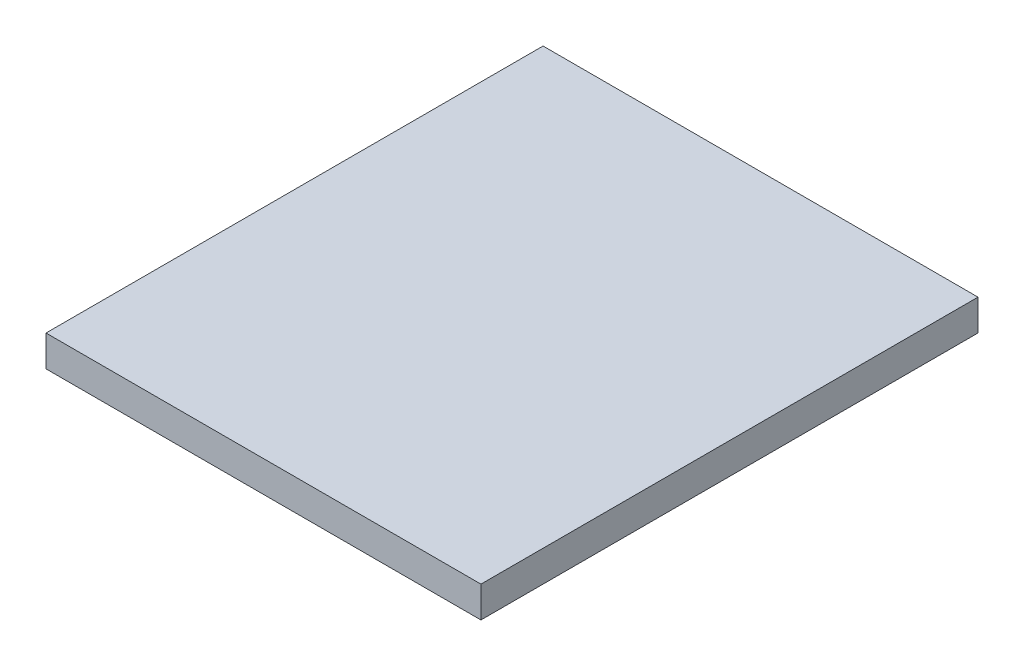
ISO-10303-21;
HEADER;
FILE_DESCRIPTION(('STEP AP214'),'2;1');
FILE_NAME('part.step','',(''),(''),'','','');
FILE_SCHEMA(('AUTOMOTIVE_DESIGN { 1 0 10303 214 1 1 1 1 }'));
ENDSEC;
DATA;
#1=APPLICATION_CONTEXT('core data for automotive mechanical design processes');
#2=APPLICATION_PROTOCOL_DEFINITION('international standard','automotive_design',2000,#1);
#3=PRODUCT_CONTEXT('',#1,'mechanical');
#4=PRODUCT('Part','Part','',(#3));
#5=PRODUCT_RELATED_PRODUCT_CATEGORY('part','',(#4));
#6=PRODUCT_DEFINITION_FORMATION('','',#4);
#7=PRODUCT_DEFINITION_CONTEXT('part definition',#1,'design');
#8=PRODUCT_DEFINITION('design','',#6,#7);
#9=PRODUCT_DEFINITION_SHAPE('','',#8);
#10=(LENGTH_UNIT() NAMED_UNIT(*) SI_UNIT(.MILLI.,.METRE.));
#11=(NAMED_UNIT(*) PLANE_ANGLE_UNIT() SI_UNIT($,.RADIAN.));
#12=(NAMED_UNIT(*) SI_UNIT($,.STERADIAN.) SOLID_ANGLE_UNIT());
#13=UNCERTAINTY_MEASURE_WITH_UNIT(LENGTH_MEASURE(1.E-05),#10,'distance_accuracy_value','');
#14=(GEOMETRIC_REPRESENTATION_CONTEXT(3) GLOBAL_UNCERTAINTY_ASSIGNED_CONTEXT((#13)) GLOBAL_UNIT_ASSIGNED_CONTEXT((#10,
#11,#12)) REPRESENTATION_CONTEXT('',''));
#15=CARTESIAN_POINT('',(0.,0.,0.));
#16=DIRECTION('',(0.,0.,1.));
#17=DIRECTION('',(1.,0.,0.));
#18=AXIS2_PLACEMENT_3D('',#15,#16,#17);
#19=CARTESIAN_POINT('',(-355.6,25.4,-406.4));
#20=DIRECTION('',(1.,0.,0.));
#21=DIRECTION('',(0.,0.,-1.));
#22=AXIS2_PLACEMENT_3D('',#19,#20,#21);
#23=PLANE('',#22);
#24=DIRECTION('',(0.,0.,1.));
#25=VECTOR('',#24,1.);
#26=CARTESIAN_POINT('',(-355.6,-25.4,-406.4));
#27=LINE('',#26,#25);
#28=CARTESIAN_POINT('',(-355.6,-25.4,-406.4));
#29=VERTEX_POINT('',#28);
#30=CARTESIAN_POINT('',(-355.6,-25.4,406.4));
#31=VERTEX_POINT('',#30);
#32=EDGE_CURVE('E96',#29,#31,#27,.T.);
#33=ORIENTED_EDGE('',*,*,#32,.T.);
#34=DIRECTION('',(0.,-1.,0.));
#35=VECTOR('',#34,1.);
#36=CARTESIAN_POINT('',(-355.6,25.4,406.4));
#37=LINE('',#36,#35);
#38=CARTESIAN_POINT('',(-355.6,25.4,406.4));
#39=VERTEX_POINT('',#38);
#40=EDGE_CURVE('E11',#39,#31,#37,.T.);
#41=ORIENTED_EDGE('',*,*,#40,.F.);
#42=DIRECTION('',(0.,0.,1.));
#43=VECTOR('',#42,1.);
#44=CARTESIAN_POINT('',(-355.6,25.4,-406.4));
#45=LINE('',#44,#43);
#46=CARTESIAN_POINT('',(-355.6,25.4,-406.4));
#47=VERTEX_POINT('',#46);
#48=EDGE_CURVE('E84',#47,#39,#45,.T.);
#49=ORIENTED_EDGE('',*,*,#48,.F.);
#50=DIRECTION('',(0.,-1.,0.));
#51=VECTOR('',#50,1.);
#52=CARTESIAN_POINT('',(-355.6,25.4,-406.4));
#53=LINE('',#52,#51);
#54=EDGE_CURVE('E92',#47,#29,#53,.T.);
#55=ORIENTED_EDGE('',*,*,#54,.T.);
#56=EDGE_LOOP('',(#33,#41,#49,#55));
#57=FACE_BOUND('',#56,.T.);
#58=ADVANCED_FACE('F33',(#57),#23,.F.);
#59=CARTESIAN_POINT('',(-355.6,25.4,406.4));
#60=DIRECTION('',(0.,0.,-1.));
#61=DIRECTION('',(-1.,0.,0.));
#62=AXIS2_PLACEMENT_3D('',#59,#60,#61);
#63=PLANE('',#62);
#64=DIRECTION('',(1.,0.,0.));
#65=VECTOR('',#64,1.);
#66=CARTESIAN_POINT('',(-355.6,-25.4,406.4));
#67=LINE('',#66,#65);
#68=CARTESIAN_POINT('',(355.6,-25.4,406.4));
#69=VERTEX_POINT('',#68);
#70=EDGE_CURVE('E88',#31,#69,#67,.T.);
#71=ORIENTED_EDGE('',*,*,#70,.T.);
#72=DIRECTION('',(0.,-1.,0.));
#73=VECTOR('',#72,1.);
#74=CARTESIAN_POINT('',(355.6,25.4,406.4));
#75=LINE('',#74,#73);
#76=CARTESIAN_POINT('',(355.6,25.4,406.4));
#77=VERTEX_POINT('',#76);
#78=EDGE_CURVE('E41',#77,#69,#75,.T.);
#79=ORIENTED_EDGE('',*,*,#78,.F.);
#80=DIRECTION('',(1.,0.,0.));
#81=VECTOR('',#80,1.);
#82=CARTESIAN_POINT('',(-355.6,25.4,406.4));
#83=LINE('',#82,#81);
#84=EDGE_CURVE('E79',#39,#77,#83,.T.);
#85=ORIENTED_EDGE('',*,*,#84,.F.);
#86=ORIENTED_EDGE('',*,*,#40,.T.);
#87=EDGE_LOOP('',(#71,#79,#85,#86));
#88=FACE_BOUND('',#87,.T.);
#89=ADVANCED_FACE('F87',(#88),#63,.F.);
#90=CARTESIAN_POINT('',(355.6,25.4,-406.4));
#91=DIRECTION('',(-1.,0.,0.));
#92=DIRECTION('',(0.,0.,1.));
#93=AXIS2_PLACEMENT_3D('',#90,#91,#92);
#94=PLANE('',#93);
#95=DIRECTION('',(0.,0.,-1.));
#96=VECTOR('',#95,1.);
#97=CARTESIAN_POINT('',(355.6,-25.4,-406.4));
#98=LINE('',#97,#96);
#99=CARTESIAN_POINT('',(355.6,-25.4,-406.4));
#100=VERTEX_POINT('',#99);
#101=EDGE_CURVE('E66',#69,#100,#98,.T.);
#102=ORIENTED_EDGE('',*,*,#101,.T.);
#103=DIRECTION('',(0.,-1.,0.));
#104=VECTOR('',#103,1.);
#105=CARTESIAN_POINT('',(355.6,25.4,-406.4));
#106=LINE('',#105,#104);
#107=CARTESIAN_POINT('',(355.6,25.4,-406.4));
#108=VERTEX_POINT('',#107);
#109=EDGE_CURVE('E89',#108,#100,#106,.T.);
#110=ORIENTED_EDGE('',*,*,#109,.F.);
#111=DIRECTION('',(0.,0.,-1.));
#112=VECTOR('',#111,1.);
#113=CARTESIAN_POINT('',(355.6,25.4,-406.4));
#114=LINE('',#113,#112);
#115=EDGE_CURVE('E82',#77,#108,#114,.T.);
#116=ORIENTED_EDGE('',*,*,#115,.F.);
#117=ORIENTED_EDGE('',*,*,#78,.T.);
#118=EDGE_LOOP('',(#102,#110,#116,#117));
#119=FACE_BOUND('',#118,.T.);
#120=ADVANCED_FACE('F90',(#119),#94,.F.);
#121=CARTESIAN_POINT('',(-355.6,25.4,-406.4));
#122=DIRECTION('',(0.,0.,1.));
#123=DIRECTION('',(1.,0.,0.));
#124=AXIS2_PLACEMENT_3D('',#121,#122,#123);
#125=PLANE('',#124);
#126=DIRECTION('',(-1.,0.,0.));
#127=VECTOR('',#126,1.);
#128=CARTESIAN_POINT('',(-355.6,-25.4,-406.4));
#129=LINE('',#128,#127);
#130=EDGE_CURVE('E72',#100,#29,#129,.T.);
#131=ORIENTED_EDGE('',*,*,#130,.T.);
#132=ORIENTED_EDGE('',*,*,#54,.F.);
#133=DIRECTION('',(-1.,0.,0.));
#134=VECTOR('',#133,1.);
#135=CARTESIAN_POINT('',(-355.6,25.4,-406.4));
#136=LINE('',#135,#134);
#137=EDGE_CURVE('E49',#108,#47,#136,.T.);
#138=ORIENTED_EDGE('',*,*,#137,.F.);
#139=ORIENTED_EDGE('',*,*,#109,.T.);
#140=EDGE_LOOP('',(#131,#132,#138,#139));
#141=FACE_BOUND('',#140,.T.);
#142=ADVANCED_FACE('F103',(#141),#125,.F.);
#143=CARTESIAN_POINT('',(0.,25.4,0.));
#144=DIRECTION('',(0.,1.,0.));
#145=DIRECTION('',(0.,0.,1.));
#146=AXIS2_PLACEMENT_3D('',#143,#144,#145);
#147=PLANE('',#146);
#148=ORIENTED_EDGE('',*,*,#48,.T.);
#149=ORIENTED_EDGE('',*,*,#84,.T.);
#150=ORIENTED_EDGE('',*,*,#115,.T.);
#151=ORIENTED_EDGE('',*,*,#137,.T.);
#152=EDGE_LOOP('',(#148,#149,#150,#151));
#153=FACE_BOUND('',#152,.T.);
#154=ADVANCED_FACE('F80',(#153),#147,.T.);
#155=CARTESIAN_POINT('',(0.,-25.4,0.));
#156=DIRECTION('',(0.,1.,0.));
#157=DIRECTION('',(0.,0.,1.));
#158=AXIS2_PLACEMENT_3D('',#155,#156,#157);
#159=PLANE('',#158);
#160=ORIENTED_EDGE('',*,*,#32,.F.);
#161=ORIENTED_EDGE('',*,*,#130,.F.);
#162=ORIENTED_EDGE('',*,*,#101,.F.);
#163=ORIENTED_EDGE('',*,*,#70,.F.);
#164=EDGE_LOOP('',(#160,#161,#162,#163));
#165=FACE_BOUND('',#164,.T.);
#166=ADVANCED_FACE('F106',(#165),#159,.F.);
#167=CLOSED_SHELL('',(#58,#89,#120,#142,#154,#166));
#168=MANIFOLD_SOLID_BREP('B2',#167);
#169=ADVANCED_BREP_SHAPE_REPRESENTATION('',(#18,#168),#14);
#170=SHAPE_DEFINITION_REPRESENTATION(#9,#169);
ENDSEC;
END-ISO-10303-21;
